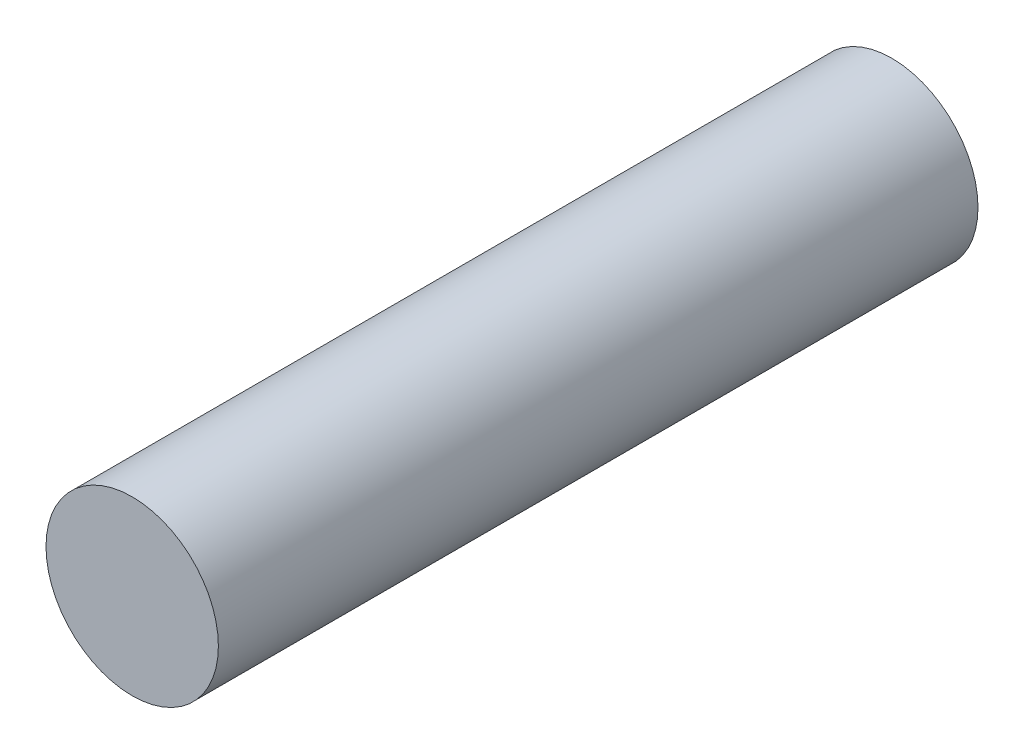
ISO-10303-21;
HEADER;
FILE_DESCRIPTION(('STEP AP214'),'2;1');
FILE_NAME('part.step','',(''),(''),'','','');
FILE_SCHEMA(('AUTOMOTIVE_DESIGN { 1 0 10303 214 1 1 1 1 }'));
ENDSEC;
DATA;
#1=APPLICATION_CONTEXT('core data for automotive mechanical design processes');
#2=APPLICATION_PROTOCOL_DEFINITION('international standard','automotive_design',2000,#1);
#3=PRODUCT_CONTEXT('',#1,'mechanical');
#4=PRODUCT('Part','Part','',(#3));
#5=PRODUCT_RELATED_PRODUCT_CATEGORY('part','',(#4));
#6=PRODUCT_DEFINITION_FORMATION('','',#4);
#7=PRODUCT_DEFINITION_CONTEXT('part definition',#1,'design');
#8=PRODUCT_DEFINITION('design','',#6,#7);
#9=PRODUCT_DEFINITION_SHAPE('','',#8);
#10=(LENGTH_UNIT() NAMED_UNIT(*) SI_UNIT(.MILLI.,.METRE.));
#11=(NAMED_UNIT(*) PLANE_ANGLE_UNIT() SI_UNIT($,.RADIAN.));
#12=(NAMED_UNIT(*) SI_UNIT($,.STERADIAN.) SOLID_ANGLE_UNIT());
#13=UNCERTAINTY_MEASURE_WITH_UNIT(LENGTH_MEASURE(1.E-05),#10,'distance_accuracy_value','');
#14=(GEOMETRIC_REPRESENTATION_CONTEXT(3) GLOBAL_UNCERTAINTY_ASSIGNED_CONTEXT((#13)) GLOBAL_UNIT_ASSIGNED_CONTEXT((#10,
#11,#12)) REPRESENTATION_CONTEXT('',''));
#15=CARTESIAN_POINT('',(0.,0.,0.));
#16=DIRECTION('',(0.,0.,1.));
#17=DIRECTION('',(1.,0.,0.));
#18=AXIS2_PLACEMENT_3D('',#15,#16,#17);
#19=CARTESIAN_POINT('',(0.,0.,26.));
#20=DIRECTION('',(0.,0.,-1.));
#21=DIRECTION('',(-1.,0.,0.));
#22=AXIS2_PLACEMENT_3D('',#19,#20,#21);
#23=CYLINDRICAL_SURFACE('',#22,2.95);
#24=CARTESIAN_POINT('',(0.,0.,26.));
#25=DIRECTION('',(0.,0.,1.));
#26=DIRECTION('',(1.,0.,0.));
#27=AXIS2_PLACEMENT_3D('',#24,#25,#26);
#28=CIRCLE('',#27,2.95);
#29=CARTESIAN_POINT('',(2.95,0.,26.));
#30=VERTEX_POINT('',#29);
#31=EDGE_CURVE('E10',#30,#30,#28,.T.);
#32=ORIENTED_EDGE('',*,*,#31,.F.);
#33=EDGE_LOOP('',(#32));
#34=FACE_BOUND('',#33,.T.);
#35=CARTESIAN_POINT('',(0.,0.,0.));
#36=DIRECTION('',(0.,0.,1.));
#37=DIRECTION('',(1.,0.,0.));
#38=AXIS2_PLACEMENT_3D('',#35,#36,#37);
#39=CIRCLE('',#38,2.95);
#40=CARTESIAN_POINT('',(2.95,0.,0.));
#41=VERTEX_POINT('',#40);
#42=EDGE_CURVE('E33',#41,#41,#39,.T.);
#43=ORIENTED_EDGE('',*,*,#42,.T.);
#44=EDGE_LOOP('',(#43));
#45=FACE_BOUND('',#44,.T.);
#46=ADVANCED_FACE('F30',(#34,#45),#23,.T.);
#47=CARTESIAN_POINT('',(0.,0.,26.));
#48=DIRECTION('',(0.,0.,1.));
#49=DIRECTION('',(1.,0.,0.));
#50=AXIS2_PLACEMENT_3D('',#47,#48,#49);
#51=PLANE('',#50);
#52=ORIENTED_EDGE('',*,*,#31,.T.);
#53=EDGE_LOOP('',(#52));
#54=FACE_BOUND('',#53,.T.);
#55=ADVANCED_FACE('F45',(#54),#51,.T.);
#56=CARTESIAN_POINT('',(0.,0.,0.));
#57=DIRECTION('',(0.,0.,1.));
#58=DIRECTION('',(1.,0.,0.));
#59=AXIS2_PLACEMENT_3D('',#56,#57,#58);
#60=PLANE('',#59);
#61=ORIENTED_EDGE('',*,*,#42,.F.);
#62=EDGE_LOOP('',(#61));
#63=FACE_BOUND('',#62,.T.);
#64=ADVANCED_FACE('F43',(#63),#60,.F.);
#65=CLOSED_SHELL('',(#46,#55,#64));
#66=MANIFOLD_SOLID_BREP('B2',#65);
#67=ADVANCED_BREP_SHAPE_REPRESENTATION('',(#18,#66),#14);
#68=SHAPE_DEFINITION_REPRESENTATION(#9,#67);
ENDSEC;
END-ISO-10303-21;
